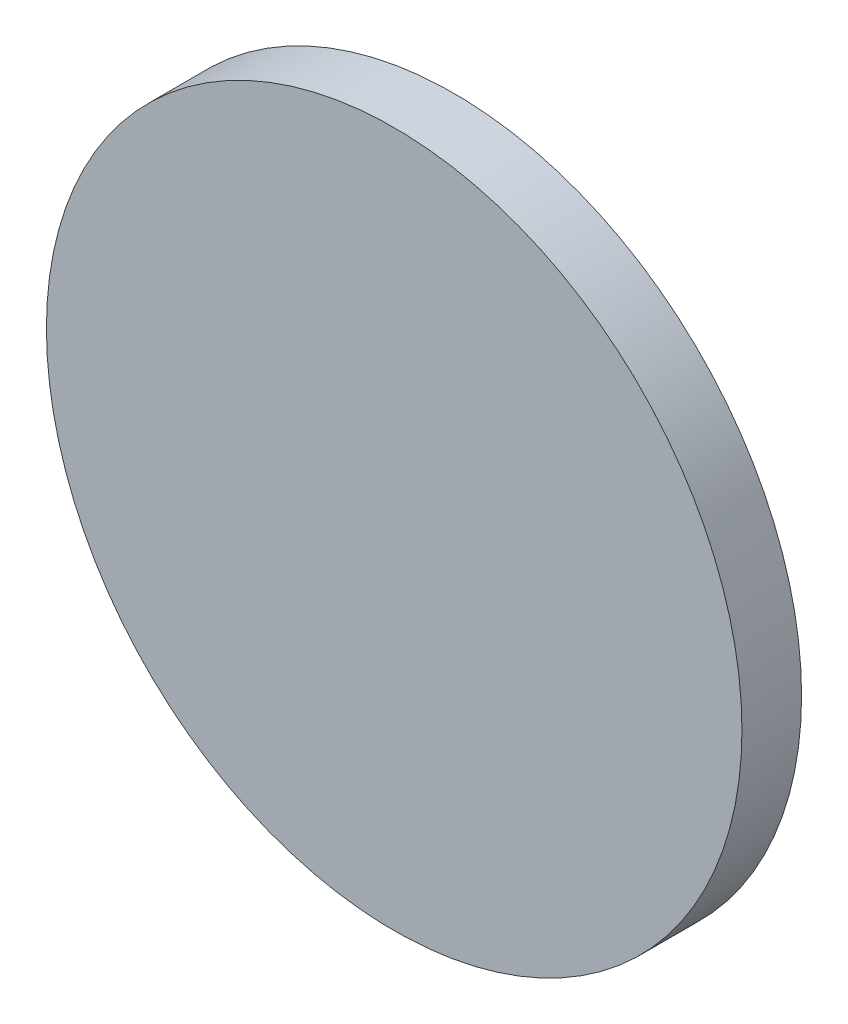
ISO-10303-21;
HEADER;
FILE_DESCRIPTION(('STEP AP214'),'2;1');
FILE_NAME('part.step','',(''),(''),'','','');
FILE_SCHEMA(('AUTOMOTIVE_DESIGN { 1 0 10303 214 1 1 1 1 }'));
ENDSEC;
DATA;
#1=APPLICATION_CONTEXT('core data for automotive mechanical design processes');
#2=APPLICATION_PROTOCOL_DEFINITION('international standard','automotive_design',2000,#1);
#3=PRODUCT_CONTEXT('',#1,'mechanical');
#4=PRODUCT('Part','Part','',(#3));
#5=PRODUCT_RELATED_PRODUCT_CATEGORY('part','',(#4));
#6=PRODUCT_DEFINITION_FORMATION('','',#4);
#7=PRODUCT_DEFINITION_CONTEXT('part definition',#1,'design');
#8=PRODUCT_DEFINITION('design','',#6,#7);
#9=PRODUCT_DEFINITION_SHAPE('','',#8);
#10=(LENGTH_UNIT() NAMED_UNIT(*) SI_UNIT(.MILLI.,.METRE.));
#11=(NAMED_UNIT(*) PLANE_ANGLE_UNIT() SI_UNIT($,.RADIAN.));
#12=(NAMED_UNIT(*) SI_UNIT($,.STERADIAN.) SOLID_ANGLE_UNIT());
#13=UNCERTAINTY_MEASURE_WITH_UNIT(LENGTH_MEASURE(1.E-05),#10,'distance_accuracy_value','');
#14=(GEOMETRIC_REPRESENTATION_CONTEXT(3) GLOBAL_UNCERTAINTY_ASSIGNED_CONTEXT((#13)) GLOBAL_UNIT_ASSIGNED_CONTEXT((#10,
#11,#12)) REPRESENTATION_CONTEXT('',''));
#15=CARTESIAN_POINT('',(0.,0.,0.));
#16=DIRECTION('',(0.,0.,1.));
#17=DIRECTION('',(1.,0.,0.));
#18=AXIS2_PLACEMENT_3D('',#15,#16,#17);
#19=CARTESIAN_POINT('',(10.629,4.339000014875,0.03429));
#20=DIRECTION('',(0.,0.,1.));
#21=DIRECTION('',(1.,0.,0.));
#22=AXIS2_PLACEMENT_3D('',#19,#20,#21);
#23=PLANE('',#22);
#24=CARTESIAN_POINT('',(10.629,4.339000014875,0.03429));
#25=DIRECTION('',(0.,0.,1.));
#26=DIRECTION('',(1.,0.,0.));
#27=AXIS2_PLACEMENT_3D('',#24,#25,#26);
#28=CIRCLE('',#27,0.200024667);
#29=CARTESIAN_POINT('',(10.829024667,4.339000014875,0.03429));
#30=VERTEX_POINT('',#29);
#31=EDGE_CURVE('E18',#30,#30,#28,.F.);
#32=ORIENTED_EDGE('',*,*,#31,.F.);
#33=EDGE_LOOP('',(#32));
#34=FACE_BOUND('',#33,.T.);
#35=ADVANCED_FACE('F15',(#34),#23,.T.);
#36=CARTESIAN_POINT('',(10.629,4.339000014875,0.));
#37=DIRECTION('',(0.,0.,1.));
#38=DIRECTION('',(1.,0.,0.));
#39=AXIS2_PLACEMENT_3D('',#36,#37,#38);
#40=CYLINDRICAL_SURFACE('',#39,0.200024667);
#41=ORIENTED_EDGE('',*,*,#31,.T.);
#42=EDGE_LOOP('',(#41));
#43=FACE_BOUND('',#42,.T.);
#44=CARTESIAN_POINT('',(10.629,4.339000014875,0.));
#45=DIRECTION('',(0.,0.,1.));
#46=DIRECTION('',(1.,0.,0.));
#47=AXIS2_PLACEMENT_3D('',#44,#45,#46);
#48=CIRCLE('',#47,0.200024667);
#49=CARTESIAN_POINT('',(10.829024667,4.339000014875,0.));
#50=VERTEX_POINT('',#49);
#51=EDGE_CURVE('E10',#50,#50,#48,.F.);
#52=ORIENTED_EDGE('',*,*,#51,.F.);
#53=EDGE_LOOP('',(#52));
#54=FACE_BOUND('',#53,.T.);
#55=ADVANCED_FACE('F27',(#43,#54),#40,.T.);
#56=CARTESIAN_POINT('',(10.629,4.339000014875,0.));
#57=DIRECTION('',(0.,0.,-1.));
#58=DIRECTION('',(-1.,0.,0.));
#59=AXIS2_PLACEMENT_3D('',#56,#57,#58);
#60=PLANE('',#59);
#61=ORIENTED_EDGE('',*,*,#51,.T.);
#62=EDGE_LOOP('',(#61));
#63=FACE_BOUND('',#62,.T.);
#64=ADVANCED_FACE('F35',(#63),#60,.T.);
#65=CLOSED_SHELL('',(#35,#55,#64));
#66=MANIFOLD_SOLID_BREP('B1',#65);
#67=ADVANCED_BREP_SHAPE_REPRESENTATION('',(#18,#66),#14);
#68=SHAPE_DEFINITION_REPRESENTATION(#9,#67);
ENDSEC;
END-ISO-10303-21;
